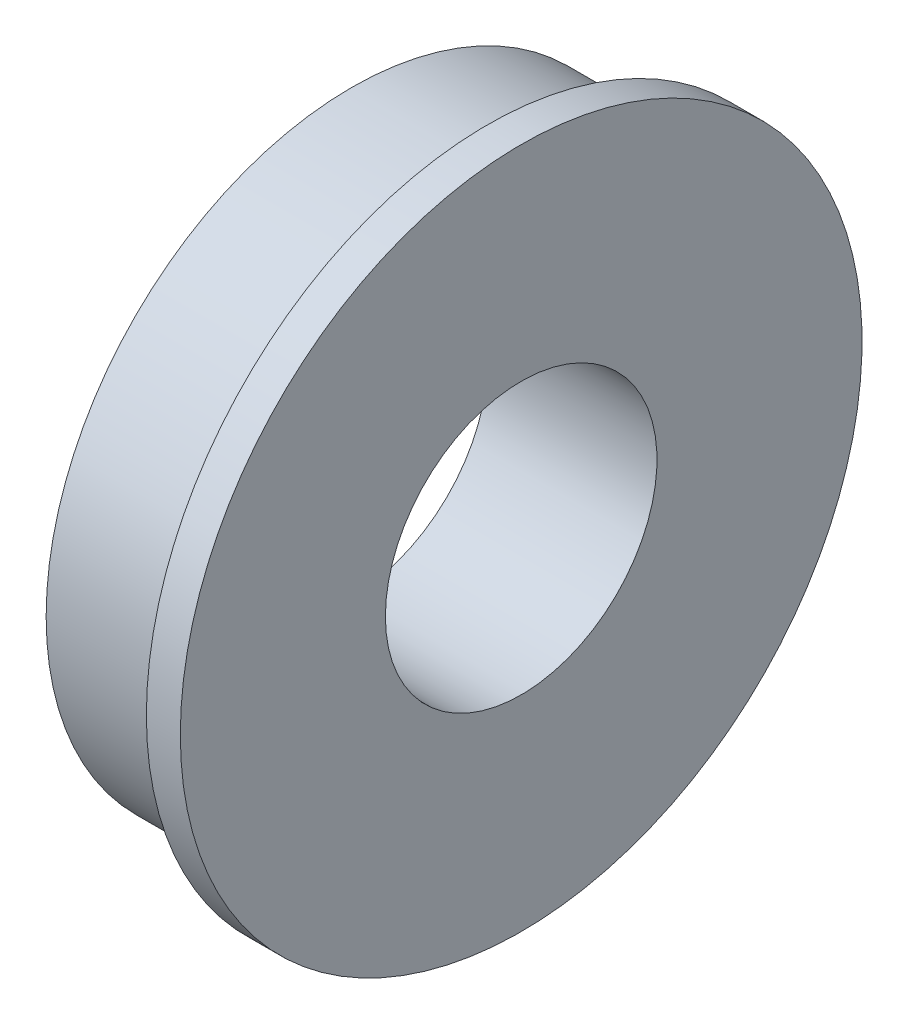
ISO-10303-21;
HEADER;
FILE_DESCRIPTION(('STEP AP214'),'2;1');
FILE_NAME('part.step','',(''),(''),'','','');
FILE_SCHEMA(('AUTOMOTIVE_DESIGN { 1 0 10303 214 1 1 1 1 }'));
ENDSEC;
DATA;
#1=APPLICATION_CONTEXT('core data for automotive mechanical design processes');
#2=APPLICATION_PROTOCOL_DEFINITION('international standard','automotive_design',2000,#1);
#3=PRODUCT_CONTEXT('',#1,'mechanical');
#4=PRODUCT('Part','Part','',(#3));
#5=PRODUCT_RELATED_PRODUCT_CATEGORY('part','',(#4));
#6=PRODUCT_DEFINITION_FORMATION('','',#4);
#7=PRODUCT_DEFINITION_CONTEXT('part definition',#1,'design');
#8=PRODUCT_DEFINITION('design','',#6,#7);
#9=PRODUCT_DEFINITION_SHAPE('','',#8);
#10=(LENGTH_UNIT() NAMED_UNIT(*) SI_UNIT(.MILLI.,.METRE.));
#11=(NAMED_UNIT(*) PLANE_ANGLE_UNIT() SI_UNIT($,.RADIAN.));
#12=(NAMED_UNIT(*) SI_UNIT($,.STERADIAN.) SOLID_ANGLE_UNIT());
#13=UNCERTAINTY_MEASURE_WITH_UNIT(LENGTH_MEASURE(1.E-05),#10,'distance_accuracy_value','');
#14=(GEOMETRIC_REPRESENTATION_CONTEXT(3) GLOBAL_UNCERTAINTY_ASSIGNED_CONTEXT((#13)) GLOBAL_UNIT_ASSIGNED_CONTEXT((#10,
#11,#12)) REPRESENTATION_CONTEXT('',''));
#15=CARTESIAN_POINT('',(0.,0.,0.));
#16=DIRECTION('',(0.,0.,1.));
#17=DIRECTION('',(1.,0.,0.));
#18=AXIS2_PLACEMENT_3D('',#15,#16,#17);
#19=CARTESIAN_POINT('',(7.9248,15.9385,0.));
#20=DIRECTION('',(-1.,0.,0.));
#21=DIRECTION('',(0.,0.,1.));
#22=AXIS2_PLACEMENT_3D('',#19,#20,#21);
#23=PLANE('',#22);
#24=CARTESIAN_POINT('',(7.9248,0.,0.));
#25=DIRECTION('',(-1.,0.,0.));
#26=DIRECTION('',(0.,0.,1.));
#27=AXIS2_PLACEMENT_3D('',#24,#25,#26);
#28=CIRCLE('',#27,15.9385);
#29=CARTESIAN_POINT('',(7.9248,0.,15.9385));
#30=VERTEX_POINT('',#29);
#31=EDGE_CURVE('E54',#30,#30,#28,.T.);
#32=ORIENTED_EDGE('',*,*,#31,.F.);
#33=EDGE_LOOP('',(#32));
#34=FACE_BOUND('',#33,.T.);
#35=CARTESIAN_POINT('',(7.9248,0.,0.));
#36=DIRECTION('',(-1.,0.,0.));
#37=DIRECTION('',(0.,0.,1.));
#38=AXIS2_PLACEMENT_3D('',#35,#36,#37);
#39=CIRCLE('',#38,6.35);
#40=CARTESIAN_POINT('',(7.9248,0.,6.35));
#41=VERTEX_POINT('',#40);
#42=EDGE_CURVE('E10',#41,#41,#39,.T.);
#43=ORIENTED_EDGE('',*,*,#42,.T.);
#44=EDGE_LOOP('',(#43));
#45=FACE_BOUND('',#44,.T.);
#46=ADVANCED_FACE('F32',(#34,#45),#23,.F.);
#47=CARTESIAN_POINT('',(0.,0.,0.));
#48=DIRECTION('',(-1.,0.,0.));
#49=DIRECTION('',(0.,0.,1.));
#50=AXIS2_PLACEMENT_3D('',#47,#48,#49);
#51=CYLINDRICAL_SURFACE('',#50,6.35);
#52=ORIENTED_EDGE('',*,*,#42,.F.);
#53=EDGE_LOOP('',(#52));
#54=FACE_BOUND('',#53,.T.);
#55=CARTESIAN_POINT('',(0.,0.,0.));
#56=DIRECTION('',(-1.,0.,0.));
#57=DIRECTION('',(0.,0.,1.));
#58=AXIS2_PLACEMENT_3D('',#55,#56,#57);
#59=CIRCLE('',#58,6.35);
#60=CARTESIAN_POINT('',(0.,0.,6.35));
#61=VERTEX_POINT('',#60);
#62=EDGE_CURVE('E38',#61,#61,#59,.T.);
#63=ORIENTED_EDGE('',*,*,#62,.T.);
#64=EDGE_LOOP('',(#63));
#65=FACE_BOUND('',#64,.T.);
#66=ADVANCED_FACE('F61',(#54,#65),#51,.F.);
#67=CARTESIAN_POINT('',(0.,6.35,0.));
#68=DIRECTION('',(1.,0.,0.));
#69=DIRECTION('',(0.,0.,-1.));
#70=AXIS2_PLACEMENT_3D('',#67,#68,#69);
#71=PLANE('',#70);
#72=ORIENTED_EDGE('',*,*,#62,.F.);
#73=EDGE_LOOP('',(#72));
#74=FACE_BOUND('',#73,.T.);
#75=CARTESIAN_POINT('',(0.,0.,0.));
#76=DIRECTION('',(-1.,0.,0.));
#77=DIRECTION('',(0.,0.,1.));
#78=AXIS2_PLACEMENT_3D('',#75,#76,#77);
#79=CIRCLE('',#78,14.2875);
#80=CARTESIAN_POINT('',(0.,0.,14.2875));
#81=VERTEX_POINT('',#80);
#82=EDGE_CURVE('E42',#81,#81,#79,.T.);
#83=ORIENTED_EDGE('',*,*,#82,.T.);
#84=EDGE_LOOP('',(#83));
#85=FACE_BOUND('',#84,.T.);
#86=ADVANCED_FACE('F65',(#74,#85),#71,.F.);
#87=CARTESIAN_POINT('',(0.,0.,0.));
#88=DIRECTION('',(-1.,0.,0.));
#89=DIRECTION('',(0.,0.,1.));
#90=AXIS2_PLACEMENT_3D('',#87,#88,#89);
#91=CYLINDRICAL_SURFACE('',#90,14.2875);
#92=ORIENTED_EDGE('',*,*,#82,.F.);
#93=EDGE_LOOP('',(#92));
#94=FACE_BOUND('',#93,.T.);
#95=CARTESIAN_POINT('',(6.3373,0.,0.));
#96=DIRECTION('',(-1.,0.,0.));
#97=DIRECTION('',(0.,0.,1.));
#98=AXIS2_PLACEMENT_3D('',#95,#96,#97);
#99=CIRCLE('',#98,14.2875);
#100=CARTESIAN_POINT('',(6.3373,0.,14.2875));
#101=VERTEX_POINT('',#100);
#102=EDGE_CURVE('E46',#101,#101,#99,.T.);
#103=ORIENTED_EDGE('',*,*,#102,.T.);
#104=EDGE_LOOP('',(#103));
#105=FACE_BOUND('',#104,.T.);
#106=ADVANCED_FACE('F70',(#94,#105),#91,.T.);
#107=CARTESIAN_POINT('',(6.3373,14.2875,0.));
#108=DIRECTION('',(1.,0.,0.));
#109=DIRECTION('',(0.,0.,-1.));
#110=AXIS2_PLACEMENT_3D('',#107,#108,#109);
#111=PLANE('',#110);
#112=ORIENTED_EDGE('',*,*,#102,.F.);
#113=EDGE_LOOP('',(#112));
#114=FACE_BOUND('',#113,.T.);
#115=CARTESIAN_POINT('',(6.3373,0.,0.));
#116=DIRECTION('',(-1.,0.,0.));
#117=DIRECTION('',(0.,0.,1.));
#118=AXIS2_PLACEMENT_3D('',#115,#116,#117);
#119=CIRCLE('',#118,15.9385);
#120=CARTESIAN_POINT('',(6.3373,0.,15.9385));
#121=VERTEX_POINT('',#120);
#122=EDGE_CURVE('E51',#121,#121,#119,.T.);
#123=ORIENTED_EDGE('',*,*,#122,.T.);
#124=EDGE_LOOP('',(#123));
#125=FACE_BOUND('',#124,.T.);
#126=ADVANCED_FACE('F76',(#114,#125),#111,.F.);
#127=CARTESIAN_POINT('',(0.,0.,0.));
#128=DIRECTION('',(-1.,0.,0.));
#129=DIRECTION('',(0.,0.,1.));
#130=AXIS2_PLACEMENT_3D('',#127,#128,#129);
#131=CYLINDRICAL_SURFACE('',#130,15.9385);
#132=ORIENTED_EDGE('',*,*,#122,.F.);
#133=EDGE_LOOP('',(#132));
#134=FACE_BOUND('',#133,.T.);
#135=ORIENTED_EDGE('',*,*,#31,.T.);
#136=EDGE_LOOP('',(#135));
#137=FACE_BOUND('',#136,.T.);
#138=ADVANCED_FACE('F58',(#134,#137),#131,.T.);
#139=CLOSED_SHELL('',(#46,#66,#86,#106,#126,#138));
#140=MANIFOLD_SOLID_BREP('B2',#139);
#141=ADVANCED_BREP_SHAPE_REPRESENTATION('',(#18,#140),#14);
#142=SHAPE_DEFINITION_REPRESENTATION(#9,#141);
ENDSEC;
END-ISO-10303-21;
